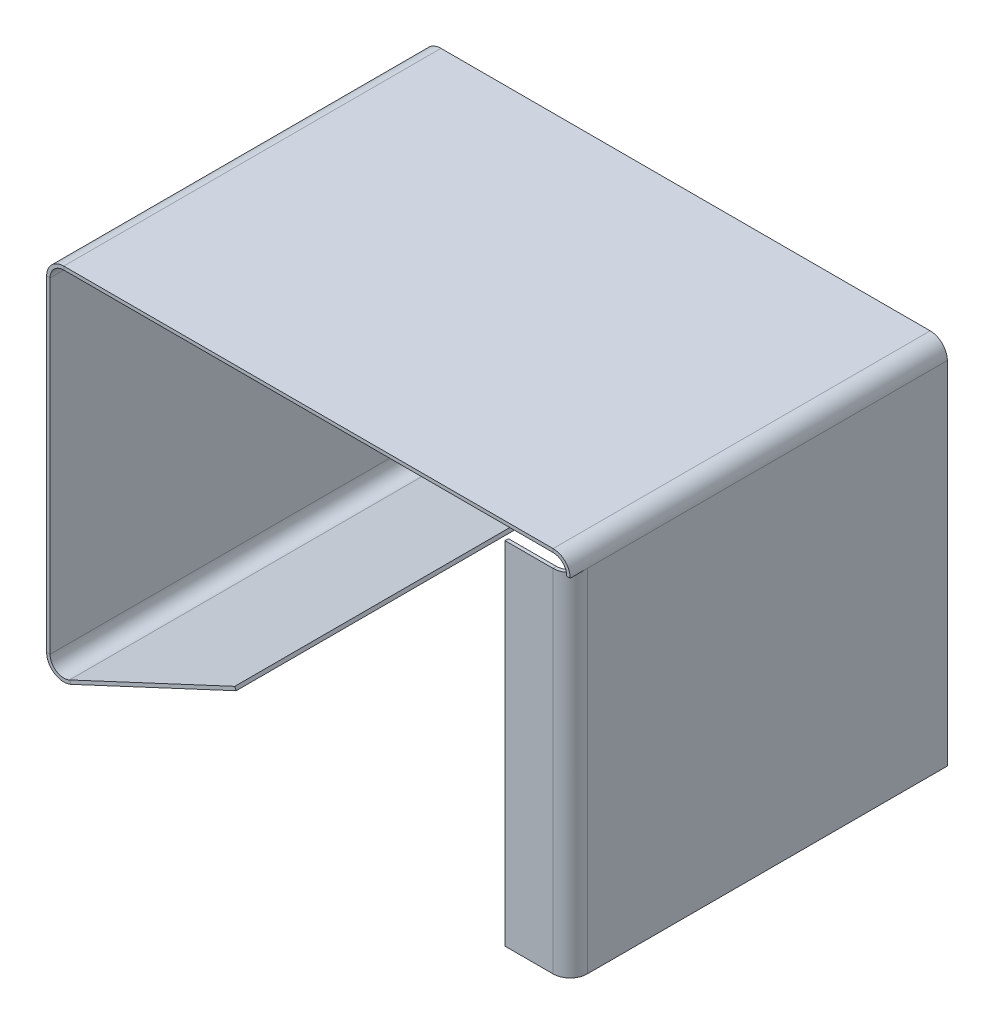
ISO-10303-21;
HEADER;
FILE_DESCRIPTION(('STEP AP214'),'2;1');
FILE_NAME('part.step','',(''),(''),'','','');
FILE_SCHEMA(('AUTOMOTIVE_DESIGN { 1 0 10303 214 1 1 1 1 }'));
ENDSEC;
DATA;
#1=APPLICATION_CONTEXT('core data for automotive mechanical design processes');
#2=APPLICATION_PROTOCOL_DEFINITION('international standard','automotive_design',2000,#1);
#3=PRODUCT_CONTEXT('',#1,'mechanical');
#4=PRODUCT('Part','Part','',(#3));
#5=PRODUCT_RELATED_PRODUCT_CATEGORY('part','',(#4));
#6=PRODUCT_DEFINITION_FORMATION('','',#4);
#7=PRODUCT_DEFINITION_CONTEXT('part definition',#1,'design');
#8=PRODUCT_DEFINITION('design','',#6,#7);
#9=PRODUCT_DEFINITION_SHAPE('','',#8);
#10=(LENGTH_UNIT() NAMED_UNIT(*) SI_UNIT(.MILLI.,.METRE.));
#11=(NAMED_UNIT(*) PLANE_ANGLE_UNIT() SI_UNIT($,.RADIAN.));
#12=(NAMED_UNIT(*) SI_UNIT($,.STERADIAN.) SOLID_ANGLE_UNIT());
#13=UNCERTAINTY_MEASURE_WITH_UNIT(LENGTH_MEASURE(1.E-05),#10,'distance_accuracy_value','');
#14=(GEOMETRIC_REPRESENTATION_CONTEXT(3) GLOBAL_UNCERTAINTY_ASSIGNED_CONTEXT((#13)) GLOBAL_UNIT_ASSIGNED_CONTEXT((#10,
#11,#12)) REPRESENTATION_CONTEXT('',''));
#15=CARTESIAN_POINT('',(0.,0.,0.));
#16=DIRECTION('',(0.,0.,1.));
#17=DIRECTION('',(1.,0.,0.));
#18=AXIS2_PLACEMENT_3D('',#15,#16,#17);
#19=CARTESIAN_POINT('',(75.3483962800155,49.2186624203822,110.));
#20=DIRECTION('',(0.,-1.,0.));
#21=DIRECTION('',(0.,0.,-1.));
#22=AXIS2_PLACEMENT_3D('',#19,#20,#21);
#23=PLANE('',#22);
#24=DIRECTION('',(0.,0.,-1.));
#25=VECTOR('',#24,1.);
#26=CARTESIAN_POINT('',(75.3483962800155,49.2186624203822,110.));
#27=LINE('',#26,#25);
#28=CARTESIAN_POINT('',(75.3483962800155,49.2186624203822,110.));
#29=VERTEX_POINT('',#28);
#30=CARTESIAN_POINT('',(75.3483962800155,49.2186624203822,108.));
#31=VERTEX_POINT('',#30);
#32=EDGE_CURVE('E390',#29,#31,#27,.T.);
#33=ORIENTED_EDGE('',*,*,#32,.T.);
#34=CARTESIAN_POINT('',(71.3483962800156,49.2186624203822,105.));
#35=DIRECTION('',(0.,1.,0.));
#36=DIRECTION('',(0.,0.,1.));
#37=AXIS2_PLACEMENT_3D('',#34,#35,#36);
#38=CIRCLE('',#37,5.);
#39=CARTESIAN_POINT('',(76.3483962800155,49.2186624203822,105.));
#40=VERTEX_POINT('',#39);
#41=EDGE_CURVE('E13',#31,#40,#38,.T.);
#42=ORIENTED_EDGE('',*,*,#41,.T.);
#43=DIRECTION('',(0.,0.,-1.));
#44=VECTOR('',#43,1.);
#45=CARTESIAN_POINT('',(76.3483962800155,49.2186624203822,110.));
#46=LINE('',#45,#44);
#47=CARTESIAN_POINT('',(76.3483962800155,49.2186624203822,110.));
#48=VERTEX_POINT('',#47);
#49=EDGE_CURVE('E411',#48,#40,#46,.T.);
#50=ORIENTED_EDGE('',*,*,#49,.F.);
#51=DIRECTION('',(-1.,0.,0.));
#52=VECTOR('',#51,1.);
#53=CARTESIAN_POINT('',(76.3483962800155,49.2186624203822,110.));
#54=LINE('',#53,#52);
#55=EDGE_CURVE('E423',#48,#29,#54,.T.);
#56=ORIENTED_EDGE('',*,*,#55,.T.);
#57=EDGE_LOOP('',(#33,#42,#50,#56));
#58=FACE_BOUND('',#57,.T.);
#59=ADVANCED_FACE('F77',(#58),#23,.T.);
#60=CARTESIAN_POINT('',(75.3483962800155,53.2186624203822,110.));
#61=DIRECTION('',(1.,0.,0.));
#62=DIRECTION('',(0.,0.,-1.));
#63=AXIS2_PLACEMENT_3D('',#60,#61,#62);
#64=PLANE('',#63);
#65=DIRECTION('',(0.,1.,0.));
#66=VECTOR('',#65,1.);
#67=CARTESIAN_POINT('',(75.3483962800156,49.2186624203822,105.));
#68=LINE('',#67,#66);
#69=CARTESIAN_POINT('',(75.3483962800156,49.2186624203822,105.));
#70=VERTEX_POINT('',#69);
#71=CARTESIAN_POINT('',(75.3483962800155,-53.2186624203822,105.));
#72=VERTEX_POINT('',#71);
#73=EDGE_CURVE('E276',#70,#72,#68,.F.);
#74=ORIENTED_EDGE('',*,*,#73,.F.);
#75=CARTESIAN_POINT('',(75.3483962800155,49.2186624203822,0.));
#76=VERTEX_POINT('',#75);
#77=EDGE_CURVE('E360',#70,#76,#27,.T.);
#78=ORIENTED_EDGE('',*,*,#77,.T.);
#79=DIRECTION('',(0.,-1.,0.));
#80=VECTOR('',#79,1.);
#81=CARTESIAN_POINT('',(75.3483962800155,53.2186624203822,0.));
#82=LINE('',#81,#80);
#83=CARTESIAN_POINT('',(75.3483962800155,-53.2186624203822,0.));
#84=VERTEX_POINT('',#83);
#85=EDGE_CURVE('E334',#76,#84,#82,.T.);
#86=ORIENTED_EDGE('',*,*,#85,.T.);
#87=DIRECTION('',(0.,0.,-1.));
#88=VECTOR('',#87,1.);
#89=CARTESIAN_POINT('',(75.3483962800155,-53.2186624203822,110.));
#90=LINE('',#89,#88);
#91=EDGE_CURVE('E416',#72,#84,#90,.T.);
#92=ORIENTED_EDGE('',*,*,#91,.F.);
#93=EDGE_LOOP('',(#74,#78,#86,#92));
#94=FACE_BOUND('',#93,.T.);
#95=ADVANCED_FACE('F499',(#94),#64,.F.);
#96=CARTESIAN_POINT('',(76.3483962800155,53.2186624203822,110.));
#97=DIRECTION('',(1.,0.,0.));
#98=DIRECTION('',(0.,0.,-1.));
#99=AXIS2_PLACEMENT_3D('',#96,#97,#98);
#100=PLANE('',#99);
#101=CARTESIAN_POINT('',(76.3483962800155,49.2186624203822,0.));
#102=VERTEX_POINT('',#101);
#103=EDGE_CURVE('E410',#40,#102,#46,.T.);
#104=ORIENTED_EDGE('',*,*,#103,.F.);
#105=DIRECTION('',(0.,1.,0.));
#106=VECTOR('',#105,1.);
#107=CARTESIAN_POINT('',(76.3483962800156,49.2186624203822,105.));
#108=LINE('',#107,#106);
#109=CARTESIAN_POINT('',(76.3483962800155,-53.2186624203822,105.));
#110=VERTEX_POINT('',#109);
#111=EDGE_CURVE('E267',#40,#110,#108,.F.);
#112=ORIENTED_EDGE('',*,*,#111,.T.);
#113=DIRECTION('',(0.,0.,-1.));
#114=VECTOR('',#113,1.);
#115=CARTESIAN_POINT('',(76.3483962800155,-53.2186624203822,110.));
#116=LINE('',#115,#114);
#117=CARTESIAN_POINT('',(76.3483962800155,-53.2186624203822,0.));
#118=VERTEX_POINT('',#117);
#119=EDGE_CURVE('E414',#110,#118,#116,.T.);
#120=ORIENTED_EDGE('',*,*,#119,.T.);
#121=DIRECTION('',(0.,1.,0.));
#122=VECTOR('',#121,1.);
#123=CARTESIAN_POINT('',(76.3483962800155,53.2186624203822,0.));
#124=LINE('',#123,#122);
#125=EDGE_CURVE('E366',#102,#118,#124,.F.);
#126=ORIENTED_EDGE('',*,*,#125,.F.);
#127=EDGE_LOOP('',(#104,#112,#120,#126));
#128=FACE_BOUND('',#127,.T.);
#129=ADVANCED_FACE('F477',(#128),#100,.T.);
#130=CARTESIAN_POINT('',(-76.3483962800155,53.2186624203822,110.));
#131=DIRECTION('',(-1.,0.,0.));
#132=DIRECTION('',(0.,0.,1.));
#133=AXIS2_PLACEMENT_3D('',#130,#131,#132);
#134=PLANE('',#133);
#135=DIRECTION('',(0.,1.,0.));
#136=VECTOR('',#135,1.);
#137=CARTESIAN_POINT('',(-76.3483962800155,53.2186624203822,0.));
#138=LINE('',#137,#136);
#139=CARTESIAN_POINT('',(-76.3483962800155,-45.8365421929497,0.));
#140=VERTEX_POINT('',#139);
#141=CARTESIAN_POINT('',(-76.3483962800156,49.2186624203822,0.));
#142=VERTEX_POINT('',#141);
#143=EDGE_CURVE('E378',#140,#142,#138,.T.);
#144=ORIENTED_EDGE('',*,*,#143,.F.);
#145=DIRECTION('',(0.,0.,-1.));
#146=VECTOR('',#145,1.);
#147=CARTESIAN_POINT('',(-76.3483962800155,-45.8365421929497,0.));
#148=LINE('',#147,#146);
#149=CARTESIAN_POINT('',(-76.3483962800155,-45.8365421929498,110.));
#150=VERTEX_POINT('',#149);
#151=EDGE_CURVE('E314',#140,#150,#148,.F.);
#152=ORIENTED_EDGE('',*,*,#151,.T.);
#153=DIRECTION('',(0.,1.,0.));
#154=VECTOR('',#153,1.);
#155=CARTESIAN_POINT('',(-76.3483962800155,53.2186624203822,110.));
#156=LINE('',#155,#154);
#157=CARTESIAN_POINT('',(-76.3483962800156,49.2186624203822,110.));
#158=VERTEX_POINT('',#157);
#159=EDGE_CURVE('E347',#150,#158,#156,.T.);
#160=ORIENTED_EDGE('',*,*,#159,.T.);
#161=DIRECTION('',(0.,0.,-1.));
#162=VECTOR('',#161,1.);
#163=CARTESIAN_POINT('',(-76.3483962800156,49.2186624203822,110.));
#164=LINE('',#163,#162);
#165=EDGE_CURVE('E401',#158,#142,#164,.T.);
#166=ORIENTED_EDGE('',*,*,#165,.T.);
#167=EDGE_LOOP('',(#144,#152,#160,#166));
#168=FACE_BOUND('',#167,.T.);
#169=ADVANCED_FACE('F577',(#168),#134,.T.);
#170=CARTESIAN_POINT('',(-75.3483962800155,53.2186624203822,110.));
#171=DIRECTION('',(-1.,0.,0.));
#172=DIRECTION('',(0.,0.,1.));
#173=AXIS2_PLACEMENT_3D('',#170,#171,#172);
#174=PLANE('',#173);
#175=DIRECTION('',(0.,0.,-1.));
#176=VECTOR('',#175,1.);
#177=CARTESIAN_POINT('',(-75.3483962800155,-45.8365421929497,0.));
#178=LINE('',#177,#176);
#179=CARTESIAN_POINT('',(-75.3483962800155,-45.8365421929497,0.));
#180=VERTEX_POINT('',#179);
#181=CARTESIAN_POINT('',(-75.3483962800155,-45.8365421929497,110.));
#182=VERTEX_POINT('',#181);
#183=EDGE_CURVE('E327',#180,#182,#178,.F.);
#184=ORIENTED_EDGE('',*,*,#183,.F.);
#185=DIRECTION('',(0.,1.,0.));
#186=VECTOR('',#185,1.);
#187=CARTESIAN_POINT('',(-75.3483962800155,53.2186624203822,0.));
#188=LINE('',#187,#186);
#189=CARTESIAN_POINT('',(-75.3483962800155,49.2186624203822,0.));
#190=VERTEX_POINT('',#189);
#191=EDGE_CURVE('E380',#180,#190,#188,.T.);
#192=ORIENTED_EDGE('',*,*,#191,.T.);
#193=DIRECTION('',(0.,0.,-1.));
#194=VECTOR('',#193,1.);
#195=CARTESIAN_POINT('',(-75.3483962800155,49.2186624203822,110.));
#196=LINE('',#195,#194);
#197=CARTESIAN_POINT('',(-75.3483962800155,49.2186624203822,110.));
#198=VERTEX_POINT('',#197);
#199=EDGE_CURVE('E398',#198,#190,#196,.T.);
#200=ORIENTED_EDGE('',*,*,#199,.F.);
#201=DIRECTION('',(0.,1.,0.));
#202=VECTOR('',#201,1.);
#203=CARTESIAN_POINT('',(-75.3483962800155,53.2186624203822,110.));
#204=LINE('',#203,#202);
#205=EDGE_CURVE('E349',#182,#198,#204,.T.);
#206=ORIENTED_EDGE('',*,*,#205,.F.);
#207=EDGE_LOOP('',(#184,#192,#200,#206));
#208=FACE_BOUND('',#207,.T.);
#209=ADVANCED_FACE('F563',(#208),#174,.F.);
#210=CARTESIAN_POINT('',(71.3483962800155,49.2186624203822,0.));
#211=DIRECTION('',(0.,0.,1.));
#212=DIRECTION('',(1.,0.,0.));
#213=AXIS2_PLACEMENT_3D('',#210,#211,#212);
#214=PLANE('',#213);
#215=DIRECTION('',(-1.,0.,0.));
#216=VECTOR('',#215,1.);
#217=CARTESIAN_POINT('',(-75.3483962800155,-45.8365421929497,0.));
#218=LINE('',#217,#216);
#219=EDGE_CURVE('E321',#180,#140,#218,.T.);
#220=ORIENTED_EDGE('',*,*,#219,.T.);
#221=ORIENTED_EDGE('',*,*,#143,.T.);
#222=DIRECTION('',(1.,0.,0.));
#223=VECTOR('',#222,1.);
#224=CARTESIAN_POINT('',(-76.3483962800156,49.2186624203822,0.));
#225=LINE('',#224,#223);
#226=EDGE_CURVE('E428',#142,#190,#225,.T.);
#227=ORIENTED_EDGE('',*,*,#226,.T.);
#228=ORIENTED_EDGE('',*,*,#191,.F.);
#229=EDGE_LOOP('',(#220,#221,#227,#228));
#230=FACE_BOUND('',#229,.T.);
#231=ADVANCED_FACE('F560',(#230),#214,.F.);
#232=CARTESIAN_POINT('',(-75.3483962800155,49.2186624203822,110.));
#233=DIRECTION('',(0.,0.,1.));
#234=DIRECTION('',(1.,0.,0.));
#235=AXIS2_PLACEMENT_3D('',#232,#233,#234);
#236=PLANE('',#235);
#237=DIRECTION('',(-1.,0.,0.));
#238=VECTOR('',#237,1.);
#239=CARTESIAN_POINT('',(-75.3483962800155,49.2186624203822,110.));
#240=LINE('',#239,#238);
#241=EDGE_CURVE('E81',#198,#158,#240,.T.);
#242=ORIENTED_EDGE('',*,*,#241,.F.);
#243=CARTESIAN_POINT('',(-71.3483962800156,49.2186624203822,110.));
#244=DIRECTION('',(0.,0.,1.));
#245=DIRECTION('',(1.,0.,0.));
#246=AXIS2_PLACEMENT_3D('',#243,#244,#245);
#247=CIRCLE('',#246,4.);
#248=CARTESIAN_POINT('',(-71.3483962800155,53.2186624203822,110.));
#249=VERTEX_POINT('',#248);
#250=EDGE_CURVE('E351',#198,#249,#247,.F.);
#251=ORIENTED_EDGE('',*,*,#250,.T.);
#252=DIRECTION('',(0.,-1.,0.));
#253=VECTOR('',#252,1.);
#254=CARTESIAN_POINT('',(-71.3483962800155,54.2186624203822,110.));
#255=LINE('',#254,#253);
#256=CARTESIAN_POINT('',(-71.3483962800155,54.2186624203822,110.));
#257=VERTEX_POINT('',#256);
#258=EDGE_CURVE('E432',#257,#249,#255,.T.);
#259=ORIENTED_EDGE('',*,*,#258,.F.);
#260=CARTESIAN_POINT('',(-71.3483962800156,49.2186624203822,110.));
#261=DIRECTION('',(0.,0.,1.));
#262=DIRECTION('',(1.,0.,0.));
#263=AXIS2_PLACEMENT_3D('',#260,#261,#262);
#264=CIRCLE('',#263,5.);
#265=EDGE_CURVE('E344',#158,#257,#264,.F.);
#266=ORIENTED_EDGE('',*,*,#265,.F.);
#267=EDGE_LOOP('',(#242,#251,#259,#266));
#268=FACE_BOUND('',#267,.T.);
#269=ADVANCED_FACE('F79',(#268),#236,.T.);
#270=CARTESIAN_POINT('',(-71.3483962800155,54.2186624203822,110.));
#271=DIRECTION('',(0.,0.,1.));
#272=DIRECTION('',(1.,0.,0.));
#273=AXIS2_PLACEMENT_3D('',#270,#271,#272);
#274=PLANE('',#273);
#275=DIRECTION('',(-1.,0.,0.));
#276=VECTOR('',#275,1.);
#277=CARTESIAN_POINT('',(-75.3483962800155,-45.8365421929497,110.));
#278=LINE('',#277,#276);
#279=EDGE_CURVE('E331',#182,#150,#278,.T.);
#280=ORIENTED_EDGE('',*,*,#279,.F.);
#281=ORIENTED_EDGE('',*,*,#205,.T.);
#282=ORIENTED_EDGE('',*,*,#241,.T.);
#283=ORIENTED_EDGE('',*,*,#159,.F.);
#284=EDGE_LOOP('',(#280,#281,#282,#283));
#285=FACE_BOUND('',#284,.T.);
#286=ADVANCED_FACE('F441',(#285),#274,.T.);
#287=CARTESIAN_POINT('',(-71.3483962800155,53.2186624203822,0.));
#288=DIRECTION('',(0.,0.,-1.));
#289=DIRECTION('',(-1.,0.,0.));
#290=AXIS2_PLACEMENT_3D('',#287,#288,#289);
#291=PLANE('',#290);
#292=DIRECTION('',(0.,1.,0.));
#293=VECTOR('',#292,1.);
#294=CARTESIAN_POINT('',(-71.3483962800155,53.2186624203822,0.));
#295=LINE('',#294,#293);
#296=CARTESIAN_POINT('',(-71.3483962800155,53.2186624203822,0.));
#297=VERTEX_POINT('',#296);
#298=CARTESIAN_POINT('',(-71.3483962800155,54.2186624203822,0.));
#299=VERTEX_POINT('',#298);
#300=EDGE_CURVE('E431',#297,#299,#295,.T.);
#301=ORIENTED_EDGE('',*,*,#300,.F.);
#302=CARTESIAN_POINT('',(-71.3483962800156,49.2186624203822,0.));
#303=DIRECTION('',(0.,0.,1.));
#304=DIRECTION('',(1.,0.,0.));
#305=AXIS2_PLACEMENT_3D('',#302,#303,#304);
#306=CIRCLE('',#305,4.);
#307=EDGE_CURVE('E382',#190,#297,#306,.F.);
#308=ORIENTED_EDGE('',*,*,#307,.F.);
#309=ORIENTED_EDGE('',*,*,#226,.F.);
#310=CARTESIAN_POINT('',(-71.3483962800156,49.2186624203822,0.));
#311=DIRECTION('',(0.,0.,1.));
#312=DIRECTION('',(1.,0.,0.));
#313=AXIS2_PLACEMENT_3D('',#310,#311,#312);
#314=CIRCLE('',#313,5.);
#315=EDGE_CURVE('E375',#142,#299,#314,.F.);
#316=ORIENTED_EDGE('',*,*,#315,.T.);
#317=EDGE_LOOP('',(#301,#308,#309,#316));
#318=FACE_BOUND('',#317,.T.);
#319=ADVANCED_FACE('F618',(#318),#291,.T.);
#320=CARTESIAN_POINT('',(-76.3483962800156,49.2186624203822,0.));
#321=DIRECTION('',(0.,0.,-1.));
#322=DIRECTION('',(-1.,0.,0.));
#323=AXIS2_PLACEMENT_3D('',#320,#321,#322);
#324=PLANE('',#323);
#325=DIRECTION('',(1.,0.,0.));
#326=VECTOR('',#325,1.);
#327=CARTESIAN_POINT('',(75.3483962800155,53.2186624203822,0.));
#328=LINE('',#327,#326);
#329=CARTESIAN_POINT('',(71.3483962800155,53.2186624203822,0.));
#330=VERTEX_POINT('',#329);
#331=EDGE_CURVE('E385',#297,#330,#328,.T.);
#332=ORIENTED_EDGE('',*,*,#331,.F.);
#333=ORIENTED_EDGE('',*,*,#300,.T.);
#334=DIRECTION('',(1.,0.,0.));
#335=VECTOR('',#334,1.);
#336=CARTESIAN_POINT('',(75.3483962800155,54.2186624203822,0.));
#337=LINE('',#336,#335);
#338=CARTESIAN_POINT('',(71.3483962800155,54.2186624203822,0.));
#339=VERTEX_POINT('',#338);
#340=EDGE_CURVE('E372',#299,#339,#337,.T.);
#341=ORIENTED_EDGE('',*,*,#340,.T.);
#342=DIRECTION('',(0.,-1.,0.));
#343=VECTOR('',#342,1.);
#344=CARTESIAN_POINT('',(71.3483962800155,54.2186624203822,0.));
#345=LINE('',#344,#343);
#346=EDGE_CURVE('E418',#339,#330,#345,.T.);
#347=ORIENTED_EDGE('',*,*,#346,.T.);
#348=EDGE_LOOP('',(#332,#333,#341,#347));
#349=FACE_BOUND('',#348,.T.);
#350=ADVANCED_FACE('F624',(#349),#324,.T.);
#351=CARTESIAN_POINT('',(71.3483962800155,53.2186624203822,110.));
#352=DIRECTION('',(0.,0.,1.));
#353=DIRECTION('',(1.,0.,0.));
#354=AXIS2_PLACEMENT_3D('',#351,#352,#353);
#355=PLANE('',#354);
#356=DIRECTION('',(0.,1.,0.));
#357=VECTOR('',#356,1.);
#358=CARTESIAN_POINT('',(71.3483962800155,53.2186624203822,110.));
#359=LINE('',#358,#357);
#360=CARTESIAN_POINT('',(71.3483962800155,53.2186624203822,110.));
#361=VERTEX_POINT('',#360);
#362=CARTESIAN_POINT('',(71.3483962800155,54.2186624203822,110.));
#363=VERTEX_POINT('',#362);
#364=EDGE_CURVE('E426',#361,#363,#359,.T.);
#365=ORIENTED_EDGE('',*,*,#364,.F.);
#366=CARTESIAN_POINT('',(71.3483962800155,49.2186624203822,110.));
#367=DIRECTION('',(0.,0.,1.));
#368=DIRECTION('',(1.,0.,0.));
#369=AXIS2_PLACEMENT_3D('',#366,#367,#368);
#370=CIRCLE('',#369,4.);
#371=EDGE_CURVE('E357',#361,#29,#370,.F.);
#372=ORIENTED_EDGE('',*,*,#371,.T.);
#373=ORIENTED_EDGE('',*,*,#55,.F.);
#374=CARTESIAN_POINT('',(71.3483962800155,49.2186624203822,110.));
#375=DIRECTION('',(0.,0.,1.));
#376=DIRECTION('',(1.,0.,0.));
#377=AXIS2_PLACEMENT_3D('',#374,#375,#376);
#378=CIRCLE('',#377,5.);
#379=EDGE_CURVE('E337',#363,#48,#378,.F.);
#380=ORIENTED_EDGE('',*,*,#379,.F.);
#381=EDGE_LOOP('',(#365,#372,#373,#380));
#382=FACE_BOUND('',#381,.T.);
#383=ADVANCED_FACE('F467',(#382),#355,.T.);
#384=CARTESIAN_POINT('',(76.3483962800155,49.2186624203822,110.));
#385=DIRECTION('',(0.,0.,1.));
#386=DIRECTION('',(1.,0.,0.));
#387=AXIS2_PLACEMENT_3D('',#384,#385,#386);
#388=PLANE('',#387);
#389=DIRECTION('',(1.,0.,0.));
#390=VECTOR('',#389,1.);
#391=CARTESIAN_POINT('',(75.3483962800155,53.2186624203822,110.));
#392=LINE('',#391,#390);
#393=EDGE_CURVE('E354',#249,#361,#392,.T.);
#394=ORIENTED_EDGE('',*,*,#393,.T.);
#395=ORIENTED_EDGE('',*,*,#364,.T.);
#396=DIRECTION('',(1.,0.,0.));
#397=VECTOR('',#396,1.);
#398=CARTESIAN_POINT('',(75.3483962800155,54.2186624203822,110.));
#399=LINE('',#398,#397);
#400=EDGE_CURVE('E340',#257,#363,#399,.T.);
#401=ORIENTED_EDGE('',*,*,#400,.F.);
#402=ORIENTED_EDGE('',*,*,#258,.T.);
#403=EDGE_LOOP('',(#394,#395,#401,#402));
#404=FACE_BOUND('',#403,.T.);
#405=ADVANCED_FACE('F457',(#404),#388,.T.);
#406=CARTESIAN_POINT('',(75.3483962800155,49.2186624203822,0.));
#407=DIRECTION('',(0.,0.,-1.));
#408=DIRECTION('',(-1.,0.,0.));
#409=AXIS2_PLACEMENT_3D('',#406,#407,#408);
#410=PLANE('',#409);
#411=DIRECTION('',(1.,0.,0.));
#412=VECTOR('',#411,1.);
#413=CARTESIAN_POINT('',(75.3483962800155,49.2186624203822,0.));
#414=LINE('',#413,#412);
#415=EDGE_CURVE('E420',#76,#102,#414,.T.);
#416=ORIENTED_EDGE('',*,*,#415,.F.);
#417=CARTESIAN_POINT('',(71.3483962800155,49.2186624203822,0.));
#418=DIRECTION('',(0.,0.,1.));
#419=DIRECTION('',(1.,0.,0.));
#420=AXIS2_PLACEMENT_3D('',#417,#418,#419);
#421=CIRCLE('',#420,4.);
#422=EDGE_CURVE('E341',#330,#76,#421,.F.);
#423=ORIENTED_EDGE('',*,*,#422,.F.);
#424=ORIENTED_EDGE('',*,*,#346,.F.);
#425=CARTESIAN_POINT('',(71.3483962800155,49.2186624203822,0.));
#426=DIRECTION('',(0.,0.,1.));
#427=DIRECTION('',(1.,0.,0.));
#428=AXIS2_PLACEMENT_3D('',#425,#426,#427);
#429=CIRCLE('',#428,5.);
#430=EDGE_CURVE('E369',#339,#102,#429,.F.);
#431=ORIENTED_EDGE('',*,*,#430,.T.);
#432=EDGE_LOOP('',(#416,#423,#424,#431));
#433=FACE_BOUND('',#432,.T.);
#434=ADVANCED_FACE('F503',(#433),#410,.T.);
#435=CARTESIAN_POINT('',(71.3483962800155,54.2186624203822,0.));
#436=DIRECTION('',(0.,0.,-1.));
#437=DIRECTION('',(-1.,0.,0.));
#438=AXIS2_PLACEMENT_3D('',#435,#436,#437);
#439=PLANE('',#438);
#440=ORIENTED_EDGE('',*,*,#85,.F.);
#441=ORIENTED_EDGE('',*,*,#415,.T.);
#442=ORIENTED_EDGE('',*,*,#125,.T.);
#443=DIRECTION('',(-1.,0.,0.));
#444=VECTOR('',#443,1.);
#445=CARTESIAN_POINT('',(76.3483962800155,-53.2186624203822,0.));
#446=LINE('',#445,#444);
#447=EDGE_CURVE('E363',#118,#84,#446,.T.);
#448=ORIENTED_EDGE('',*,*,#447,.T.);
#449=EDGE_LOOP('',(#440,#441,#442,#448));
#450=FACE_BOUND('',#449,.T.);
#451=ADVANCED_FACE('F506',(#450),#439,.T.);
#452=CARTESIAN_POINT('',(76.3483962800155,-53.2186624203822,110.));
#453=DIRECTION('',(0.,-1.,0.));
#454=DIRECTION('',(0.,0.,-1.));
#455=AXIS2_PLACEMENT_3D('',#452,#453,#454);
#456=PLANE('',#455);
#457=DIRECTION('',(1.,0.,0.));
#458=VECTOR('',#457,1.);
#459=CARTESIAN_POINT('',(75.3483962800156,-53.2186624203822,105.));
#460=LINE('',#459,#458);
#461=EDGE_CURVE('E102',#72,#110,#460,.T.);
#462=ORIENTED_EDGE('',*,*,#461,.F.);
#463=ORIENTED_EDGE('',*,*,#91,.T.);
#464=ORIENTED_EDGE('',*,*,#447,.F.);
#465=ORIENTED_EDGE('',*,*,#119,.F.);
#466=EDGE_LOOP('',(#462,#463,#464,#465));
#467=FACE_BOUND('',#466,.T.);
#468=ADVANCED_FACE('F480',(#467),#456,.T.);
#469=CARTESIAN_POINT('',(71.3483962800155,49.2186624203822,110.));
#470=DIRECTION('',(0.,0.,-1.));
#471=DIRECTION('',(-1.,0.,0.));
#472=AXIS2_PLACEMENT_3D('',#469,#470,#471);
#473=CYLINDRICAL_SURFACE('',#472,5.);
#474=ORIENTED_EDGE('',*,*,#430,.F.);
#475=DIRECTION('',(0.,0.,-1.));
#476=VECTOR('',#475,1.);
#477=CARTESIAN_POINT('',(71.3483962800155,54.2186624203822,110.));
#478=LINE('',#477,#476);
#479=EDGE_CURVE('E407',#363,#339,#478,.T.);
#480=ORIENTED_EDGE('',*,*,#479,.F.);
#481=ORIENTED_EDGE('',*,*,#379,.T.);
#482=ORIENTED_EDGE('',*,*,#49,.T.);
#483=ORIENTED_EDGE('',*,*,#103,.T.);
#484=EDGE_LOOP('',(#474,#480,#481,#482,#483));
#485=FACE_BOUND('',#484,.T.);
#486=ADVANCED_FACE('F465',(#485),#473,.T.);
#487=CARTESIAN_POINT('',(75.3483962800155,54.2186624203822,110.));
#488=DIRECTION('',(0.,1.,0.));
#489=DIRECTION('',(0.,0.,1.));
#490=AXIS2_PLACEMENT_3D('',#487,#488,#489);
#491=PLANE('',#490);
#492=ORIENTED_EDGE('',*,*,#340,.F.);
#493=DIRECTION('',(0.,0.,-1.));
#494=VECTOR('',#493,1.);
#495=CARTESIAN_POINT('',(-71.3483962800155,54.2186624203822,110.));
#496=LINE('',#495,#494);
#497=EDGE_CURVE('E404',#257,#299,#496,.T.);
#498=ORIENTED_EDGE('',*,*,#497,.F.);
#499=ORIENTED_EDGE('',*,*,#400,.T.);
#500=ORIENTED_EDGE('',*,*,#479,.T.);
#501=EDGE_LOOP('',(#492,#498,#499,#500));
#502=FACE_BOUND('',#501,.T.);
#503=ADVANCED_FACE('F456',(#502),#491,.T.);
#504=CARTESIAN_POINT('',(-71.3483962800156,49.2186624203822,110.));
#505=DIRECTION('',(0.,0.,-1.));
#506=DIRECTION('',(-1.,0.,0.));
#507=AXIS2_PLACEMENT_3D('',#504,#505,#506);
#508=CYLINDRICAL_SURFACE('',#507,5.);
#509=ORIENTED_EDGE('',*,*,#315,.F.);
#510=ORIENTED_EDGE('',*,*,#165,.F.);
#511=ORIENTED_EDGE('',*,*,#265,.T.);
#512=ORIENTED_EDGE('',*,*,#497,.T.);
#513=EDGE_LOOP('',(#509,#510,#511,#512));
#514=FACE_BOUND('',#513,.T.);
#515=ADVANCED_FACE('F448',(#514),#508,.T.);
#516=CARTESIAN_POINT('',(-71.3483962800156,49.2186624203822,110.));
#517=DIRECTION('',(0.,0.,-1.));
#518=DIRECTION('',(-1.,0.,0.));
#519=AXIS2_PLACEMENT_3D('',#516,#517,#518);
#520=CYLINDRICAL_SURFACE('',#519,4.);
#521=ORIENTED_EDGE('',*,*,#307,.T.);
#522=DIRECTION('',(0.,0.,-1.));
#523=VECTOR('',#522,1.);
#524=CARTESIAN_POINT('',(-71.3483962800155,53.2186624203822,110.));
#525=LINE('',#524,#523);
#526=EDGE_CURVE('E395',#249,#297,#525,.T.);
#527=ORIENTED_EDGE('',*,*,#526,.F.);
#528=ORIENTED_EDGE('',*,*,#250,.F.);
#529=ORIENTED_EDGE('',*,*,#199,.T.);
#530=EDGE_LOOP('',(#521,#527,#528,#529));
#531=FACE_BOUND('',#530,.T.);
#532=ADVANCED_FACE('F570',(#531),#520,.F.);
#533=CARTESIAN_POINT('',(75.3483962800155,53.2186624203822,110.));
#534=DIRECTION('',(0.,1.,0.));
#535=DIRECTION('',(0.,0.,1.));
#536=AXIS2_PLACEMENT_3D('',#533,#534,#535);
#537=PLANE('',#536);
#538=ORIENTED_EDGE('',*,*,#331,.T.);
#539=DIRECTION('',(0.,0.,-1.));
#540=VECTOR('',#539,1.);
#541=CARTESIAN_POINT('',(71.3483962800155,53.2186624203822,110.));
#542=LINE('',#541,#540);
#543=EDGE_CURVE('E392',#361,#330,#542,.T.);
#544=ORIENTED_EDGE('',*,*,#543,.F.);
#545=ORIENTED_EDGE('',*,*,#393,.F.);
#546=ORIENTED_EDGE('',*,*,#526,.T.);
#547=EDGE_LOOP('',(#538,#544,#545,#546));
#548=FACE_BOUND('',#547,.T.);
#549=ADVANCED_FACE('F567',(#548),#537,.F.);
#550=CARTESIAN_POINT('',(71.3483962800155,49.2186624203822,110.));
#551=DIRECTION('',(0.,0.,-1.));
#552=DIRECTION('',(-1.,0.,0.));
#553=AXIS2_PLACEMENT_3D('',#550,#551,#552);
#554=CYLINDRICAL_SURFACE('',#553,4.);
#555=ORIENTED_EDGE('',*,*,#422,.T.);
#556=ORIENTED_EDGE('',*,*,#77,.F.);
#557=EDGE_CURVE('E94',#31,#70,#27,.T.);
#558=ORIENTED_EDGE('',*,*,#557,.F.);
#559=ORIENTED_EDGE('',*,*,#32,.F.);
#560=ORIENTED_EDGE('',*,*,#371,.F.);
#561=ORIENTED_EDGE('',*,*,#543,.T.);
#562=EDGE_LOOP('',(#555,#556,#558,#559,#560,#561));
#563=FACE_BOUND('',#562,.T.);
#564=ADVANCED_FACE('F505',(#563),#554,.F.);
#565=CARTESIAN_POINT('',(-71.3483962800155,-45.8365421929497,110.));
#566=DIRECTION('',(0.,0.,1.));
#567=DIRECTION('',(1.,0.,0.));
#568=AXIS2_PLACEMENT_3D('',#565,#566,#567);
#569=PLANE('',#568);
#570=DIRECTION('',(-0.422618261740697,0.906307787036651,0.));
#571=VECTOR('',#570,1.);
#572=CARTESIAN_POINT('',(-69.2353049713121,-50.368081128133,110.));
#573=LINE('',#572,#571);
#574=CARTESIAN_POINT('',(-69.6579232330528,-49.4617733410963,110.));
#575=VERTEX_POINT('',#574);
#576=CARTESIAN_POINT('',(-69.2353049713121,-50.368081128133,110.));
#577=VERTEX_POINT('',#576);
#578=EDGE_CURVE('E283',#575,#577,#573,.F.);
#579=ORIENTED_EDGE('',*,*,#578,.F.);
#580=CARTESIAN_POINT('',(-71.3483962800155,-45.8365421929497,110.));
#581=DIRECTION('',(0.,0.,-1.));
#582=DIRECTION('',(-1.,0.,0.));
#583=AXIS2_PLACEMENT_3D('',#580,#581,#582);
#584=CIRCLE('',#583,4.);
#585=EDGE_CURVE('E324',#182,#575,#584,.F.);
#586=ORIENTED_EDGE('',*,*,#585,.F.);
#587=ORIENTED_EDGE('',*,*,#279,.T.);
#588=CARTESIAN_POINT('',(-71.3483962800155,-45.8365421929497,110.));
#589=DIRECTION('',(0.,0.,-1.));
#590=DIRECTION('',(-1.,0.,0.));
#591=AXIS2_PLACEMENT_3D('',#588,#589,#590);
#592=CIRCLE('',#591,5.);
#593=EDGE_CURVE('E317',#150,#577,#592,.F.);
#594=ORIENTED_EDGE('',*,*,#593,.T.);
#595=EDGE_LOOP('',(#579,#586,#587,#594));
#596=FACE_BOUND('',#595,.T.);
#597=ADVANCED_FACE('F553',(#596),#569,.T.);
#598=CARTESIAN_POINT('',(-71.3483962800155,-45.8365421929497,0.));
#599=DIRECTION('',(0.,0.,1.));
#600=DIRECTION('',(1.,0.,0.));
#601=AXIS2_PLACEMENT_3D('',#598,#599,#600);
#602=PLANE('',#601);
#603=CARTESIAN_POINT('',(-71.3483962800155,-45.8365421929497,0.));
#604=DIRECTION('',(0.,0.,-1.));
#605=DIRECTION('',(-1.,0.,0.));
#606=AXIS2_PLACEMENT_3D('',#603,#604,#605);
#607=CIRCLE('',#606,4.);
#608=CARTESIAN_POINT('',(-69.6579232330528,-49.4617733410963,0.));
#609=VERTEX_POINT('',#608);
#610=EDGE_CURVE('E287',#609,#180,#607,.T.);
#611=ORIENTED_EDGE('',*,*,#610,.F.);
#612=DIRECTION('',(-0.422618261740697,0.906307787036651,0.));
#613=VECTOR('',#612,1.);
#614=CARTESIAN_POINT('',(-69.6579232330528,-49.4617733410963,0.));
#615=LINE('',#614,#613);
#616=CARTESIAN_POINT('',(-69.2353049713121,-50.368081128133,0.));
#617=VERTEX_POINT('',#616);
#618=EDGE_CURVE('E307',#609,#617,#615,.F.);
#619=ORIENTED_EDGE('',*,*,#618,.T.);
#620=CARTESIAN_POINT('',(-71.3483962800155,-45.8365421929497,0.));
#621=DIRECTION('',(0.,0.,-1.));
#622=DIRECTION('',(-1.,0.,0.));
#623=AXIS2_PLACEMENT_3D('',#620,#621,#622);
#624=CIRCLE('',#623,5.);
#625=EDGE_CURVE('E318',#617,#140,#624,.T.);
#626=ORIENTED_EDGE('',*,*,#625,.T.);
#627=ORIENTED_EDGE('',*,*,#219,.F.);
#628=EDGE_LOOP('',(#611,#619,#626,#627));
#629=FACE_BOUND('',#628,.T.);
#630=ADVANCED_FACE('F548',(#629),#602,.F.);
#631=CARTESIAN_POINT('',(-71.3483962800155,-45.8365421929497,0.));
#632=DIRECTION('',(0.,0.,-1.));
#633=DIRECTION('',(0.422618261740697,-0.906307787036651,0.));
#634=AXIS2_PLACEMENT_3D('',#631,#632,#633);
#635=CYLINDRICAL_SURFACE('',#634,5.);
#636=ORIENTED_EDGE('',*,*,#151,.F.);
#637=ORIENTED_EDGE('',*,*,#625,.F.);
#638=DIRECTION('',(0.,0.,-1.));
#639=VECTOR('',#638,1.);
#640=CARTESIAN_POINT('',(-69.2353049713121,-50.368081128133,110.));
#641=LINE('',#640,#639);
#642=EDGE_CURVE('E305',#617,#577,#641,.F.);
#643=ORIENTED_EDGE('',*,*,#642,.T.);
#644=ORIENTED_EDGE('',*,*,#593,.F.);
#645=EDGE_LOOP('',(#636,#637,#643,#644));
#646=FACE_BOUND('',#645,.T.);
#647=ADVANCED_FACE('F545',(#646),#635,.T.);
#648=CARTESIAN_POINT('',(-71.3483962800155,-45.8365421929497,0.));
#649=DIRECTION('',(0.,0.,-1.));
#650=DIRECTION('',(0.422618261740697,-0.906307787036651,0.));
#651=AXIS2_PLACEMENT_3D('',#648,#649,#650);
#652=CYLINDRICAL_SURFACE('',#651,4.);
#653=ORIENTED_EDGE('',*,*,#183,.T.);
#654=ORIENTED_EDGE('',*,*,#585,.T.);
#655=DIRECTION('',(0.,0.,-1.));
#656=VECTOR('',#655,1.);
#657=CARTESIAN_POINT('',(-69.6579232330528,-49.4617733410963,110.));
#658=LINE('',#657,#656);
#659=EDGE_CURVE('E310',#575,#609,#658,.T.);
#660=ORIENTED_EDGE('',*,*,#659,.T.);
#661=ORIENTED_EDGE('',*,*,#610,.T.);
#662=EDGE_LOOP('',(#653,#654,#660,#661));
#663=FACE_BOUND('',#662,.T.);
#664=ADVANCED_FACE('F543',(#663),#652,.F.);
#665=CARTESIAN_POINT('',(-74.9257780182749,-53.0215922884563,110.));
#666=DIRECTION('',(0.,0.,-1.));
#667=DIRECTION('',(-1.,0.,0.));
#668=AXIS2_PLACEMENT_3D('',#665,#666,#667);
#669=PLANE('',#668);
#670=ORIENTED_EDGE('',*,*,#578,.T.);
#671=DIRECTION('',(-0.906307787036651,-0.422618261740697,0.));
#672=VECTOR('',#671,1.);
#673=CARTESIAN_POINT('',(7.34885819968493,-14.6562993481054,110.));
#674=LINE('',#673,#672);
#675=CARTESIAN_POINT('',(-21.0636212707798,-27.9052561123547,110.));
#676=VERTEX_POINT('',#675);
#677=EDGE_CURVE('E295',#676,#577,#674,.T.);
#678=ORIENTED_EDGE('',*,*,#677,.F.);
#679=DIRECTION('',(-0.422618261740697,0.906307787036651,0.));
#680=VECTOR('',#679,1.);
#681=CARTESIAN_POINT('',(-21.0636212707798,-27.9052561123547,110.));
#682=LINE('',#681,#680);
#683=CARTESIAN_POINT('',(-21.4862395325205,-26.998948325318,110.));
#684=VERTEX_POINT('',#683);
#685=EDGE_CURVE('E288',#676,#684,#682,.T.);
#686=ORIENTED_EDGE('',*,*,#685,.T.);
#687=DIRECTION('',(0.906307787036651,0.422618261740697,0.));
#688=VECTOR('',#687,1.);
#689=CARTESIAN_POINT('',(-75.3483962800155,-52.1152845014197,110.));
#690=LINE('',#689,#688);
#691=EDGE_CURVE('E302',#684,#575,#690,.F.);
#692=ORIENTED_EDGE('',*,*,#691,.T.);
#693=EDGE_LOOP('',(#670,#678,#686,#692));
#694=FACE_BOUND('',#693,.T.);
#695=ADVANCED_FACE('F539',(#694),#669,.F.);
#696=CARTESIAN_POINT('',(-21.0636212707798,-27.9052561123547,0.));
#697=DIRECTION('',(0.,0.,1.));
#698=DIRECTION('',(1.,0.,0.));
#699=AXIS2_PLACEMENT_3D('',#696,#697,#698);
#700=PLANE('',#699);
#701=ORIENTED_EDGE('',*,*,#618,.F.);
#702=DIRECTION('',(-0.906307787036651,-0.422618261740697,0.));
#703=VECTOR('',#702,1.);
#704=CARTESIAN_POINT('',(-21.4862395325205,-26.998948325318,0.));
#705=LINE('',#704,#703);
#706=CARTESIAN_POINT('',(-21.4862395325205,-26.998948325318,0.));
#707=VERTEX_POINT('',#706);
#708=EDGE_CURVE('E300',#609,#707,#705,.F.);
#709=ORIENTED_EDGE('',*,*,#708,.T.);
#710=DIRECTION('',(-0.422618261740697,0.906307787036651,0.));
#711=VECTOR('',#710,1.);
#712=CARTESIAN_POINT('',(-21.0636212707798,-27.9052561123547,0.));
#713=LINE('',#712,#711);
#714=CARTESIAN_POINT('',(-21.0636212707798,-27.9052561123547,0.));
#715=VERTEX_POINT('',#714);
#716=EDGE_CURVE('E284',#715,#707,#713,.T.);
#717=ORIENTED_EDGE('',*,*,#716,.F.);
#718=DIRECTION('',(0.906307787036651,0.422618261740697,0.));
#719=VECTOR('',#718,1.);
#720=CARTESIAN_POINT('',(7.34885819968493,-14.6562993481054,0.));
#721=LINE('',#720,#719);
#722=EDGE_CURVE('E293',#617,#715,#721,.T.);
#723=ORIENTED_EDGE('',*,*,#722,.F.);
#724=EDGE_LOOP('',(#701,#709,#717,#723));
#725=FACE_BOUND('',#724,.T.);
#726=ADVANCED_FACE('F528',(#725),#700,.F.);
#727=CARTESIAN_POINT('',(7.34885819968493,-14.6562993481054,0.));
#728=DIRECTION('',(-0.422618261740697,0.906307787036651,0.));
#729=DIRECTION('',(-0.906307787036651,-0.422618261740697,0.));
#730=AXIS2_PLACEMENT_3D('',#727,#728,#729);
#731=PLANE('',#730);
#732=ORIENTED_EDGE('',*,*,#642,.F.);
#733=ORIENTED_EDGE('',*,*,#722,.T.);
#734=DIRECTION('',(0.,0.,1.));
#735=VECTOR('',#734,1.);
#736=CARTESIAN_POINT('',(-21.0636212707798,-27.9052561123547,0.));
#737=LINE('',#736,#735);
#738=EDGE_CURVE('E291',#715,#676,#737,.T.);
#739=ORIENTED_EDGE('',*,*,#738,.T.);
#740=ORIENTED_EDGE('',*,*,#677,.T.);
#741=EDGE_LOOP('',(#732,#733,#739,#740));
#742=FACE_BOUND('',#741,.T.);
#743=ADVANCED_FACE('F524',(#742),#731,.F.);
#744=CARTESIAN_POINT('',(6.92623993794423,-13.7499915610687,0.));
#745=DIRECTION('',(-0.422618261740697,0.906307787036651,0.));
#746=DIRECTION('',(-0.906307787036651,-0.422618261740697,0.));
#747=AXIS2_PLACEMENT_3D('',#744,#745,#746);
#748=PLANE('',#747);
#749=ORIENTED_EDGE('',*,*,#708,.F.);
#750=ORIENTED_EDGE('',*,*,#659,.F.);
#751=ORIENTED_EDGE('',*,*,#691,.F.);
#752=DIRECTION('',(0.,0.,-1.));
#753=VECTOR('',#752,1.);
#754=CARTESIAN_POINT('',(-21.4862395325205,-26.998948325318,110.));
#755=LINE('',#754,#753);
#756=EDGE_CURVE('E298',#707,#684,#755,.F.);
#757=ORIENTED_EDGE('',*,*,#756,.F.);
#758=EDGE_LOOP('',(#749,#750,#751,#757));
#759=FACE_BOUND('',#758,.T.);
#760=ADVANCED_FACE('F527',(#759),#748,.T.);
#761=CARTESIAN_POINT('',(-21.0636212707798,-27.9052561123547,110.));
#762=DIRECTION('',(-0.906307787036651,-0.422618261740697,0.));
#763=DIRECTION('',(0.422618261740697,-0.906307787036651,0.));
#764=AXIS2_PLACEMENT_3D('',#761,#762,#763);
#765=PLANE('',#764);
#766=ORIENTED_EDGE('',*,*,#756,.T.);
#767=ORIENTED_EDGE('',*,*,#685,.F.);
#768=ORIENTED_EDGE('',*,*,#738,.F.);
#769=ORIENTED_EDGE('',*,*,#716,.T.);
#770=EDGE_LOOP('',(#766,#767,#768,#769));
#771=FACE_BOUND('',#770,.T.);
#772=ADVANCED_FACE('F532',(#771),#765,.F.);
#773=CARTESIAN_POINT('',(71.3483962800156,-53.2186624203822,105.));
#774=DIRECTION('',(0.,-1.,0.));
#775=DIRECTION('',(0.,0.,-1.));
#776=AXIS2_PLACEMENT_3D('',#773,#774,#775);
#777=PLANE('',#776);
#778=DIRECTION('',(0.,0.,-1.));
#779=VECTOR('',#778,1.);
#780=CARTESIAN_POINT('',(71.3483962800156,-53.2186624203822,110.));
#781=LINE('',#780,#779);
#782=CARTESIAN_POINT('',(71.3483962800156,-53.2186624203822,109.));
#783=VERTEX_POINT('',#782);
#784=CARTESIAN_POINT('',(71.3483962800156,-53.2186624203822,110.));
#785=VERTEX_POINT('',#784);
#786=EDGE_CURVE('E249',#783,#785,#781,.F.);
#787=ORIENTED_EDGE('',*,*,#786,.F.);
#788=CARTESIAN_POINT('',(71.3483962800156,-53.2186624203822,105.));
#789=DIRECTION('',(0.,1.,0.));
#790=DIRECTION('',(0.,0.,1.));
#791=AXIS2_PLACEMENT_3D('',#788,#789,#790);
#792=CIRCLE('',#791,4.);
#793=EDGE_CURVE('E273',#72,#783,#792,.F.);
#794=ORIENTED_EDGE('',*,*,#793,.F.);
#795=ORIENTED_EDGE('',*,*,#461,.T.);
#796=CARTESIAN_POINT('',(71.3483962800156,-53.2186624203822,105.));
#797=DIRECTION('',(0.,1.,0.));
#798=DIRECTION('',(0.,0.,1.));
#799=AXIS2_PLACEMENT_3D('',#796,#797,#798);
#800=CIRCLE('',#799,5.);
#801=EDGE_CURVE('E269',#110,#785,#800,.F.);
#802=ORIENTED_EDGE('',*,*,#801,.T.);
#803=EDGE_LOOP('',(#787,#794,#795,#802));
#804=FACE_BOUND('',#803,.T.);
#805=ADVANCED_FACE('F483',(#804),#777,.T.);
#806=CARTESIAN_POINT('',(71.3483962800156,49.2186624203822,105.));
#807=DIRECTION('',(0.,-1.,0.));
#808=DIRECTION('',(0.,0.,-1.));
#809=AXIS2_PLACEMENT_3D('',#806,#807,#808);
#810=PLANE('',#809);
#811=CARTESIAN_POINT('',(71.3483962800156,49.2186624203822,110.));
#812=VERTEX_POINT('',#811);
#813=EDGE_CURVE('E87',#812,#31,#38,.T.);
#814=ORIENTED_EDGE('',*,*,#813,.T.);
#815=ORIENTED_EDGE('',*,*,#557,.T.);
#816=CARTESIAN_POINT('',(71.3483962800156,49.2186624203822,105.));
#817=DIRECTION('',(0.,1.,0.));
#818=DIRECTION('',(0.,0.,1.));
#819=AXIS2_PLACEMENT_3D('',#816,#817,#818);
#820=CIRCLE('',#819,4.);
#821=CARTESIAN_POINT('',(71.3483962800156,49.2186624203822,109.));
#822=VERTEX_POINT('',#821);
#823=EDGE_CURVE('E279',#822,#70,#820,.T.);
#824=ORIENTED_EDGE('',*,*,#823,.F.);
#825=DIRECTION('',(0.,0.,-1.));
#826=VECTOR('',#825,1.);
#827=CARTESIAN_POINT('',(71.3483962800156,49.2186624203822,109.));
#828=LINE('',#827,#826);
#829=EDGE_CURVE('E261',#822,#812,#828,.F.);
#830=ORIENTED_EDGE('',*,*,#829,.T.);
#831=EDGE_LOOP('',(#814,#815,#824,#830));
#832=FACE_BOUND('',#831,.T.);
#833=ADVANCED_FACE('F496',(#832),#810,.F.);
#834=CARTESIAN_POINT('',(71.3483962800156,49.2186624203822,105.));
#835=DIRECTION('',(0.,1.,0.));
#836=DIRECTION('',(0.,0.,1.));
#837=AXIS2_PLACEMENT_3D('',#834,#835,#836);
#838=CYLINDRICAL_SURFACE('',#837,5.);
#839=ORIENTED_EDGE('',*,*,#111,.F.);
#840=ORIENTED_EDGE('',*,*,#41,.F.);
#841=ORIENTED_EDGE('',*,*,#813,.F.);
#842=DIRECTION('',(0.,1.,0.));
#843=VECTOR('',#842,1.);
#844=CARTESIAN_POINT('',(71.3483962800156,-53.2186624203822,110.));
#845=LINE('',#844,#843);
#846=EDGE_CURVE('E259',#812,#785,#845,.F.);
#847=ORIENTED_EDGE('',*,*,#846,.T.);
#848=ORIENTED_EDGE('',*,*,#801,.F.);
#849=EDGE_LOOP('',(#839,#840,#841,#847,#848));
#850=FACE_BOUND('',#849,.T.);
#851=ADVANCED_FACE('F475',(#850),#838,.T.);
#852=CARTESIAN_POINT('',(71.3483962800156,49.2186624203822,105.));
#853=DIRECTION('',(0.,1.,0.));
#854=DIRECTION('',(0.,0.,1.));
#855=AXIS2_PLACEMENT_3D('',#852,#853,#854);
#856=CYLINDRICAL_SURFACE('',#855,4.);
#857=ORIENTED_EDGE('',*,*,#73,.T.);
#858=ORIENTED_EDGE('',*,*,#793,.T.);
#859=DIRECTION('',(0.,1.,0.));
#860=VECTOR('',#859,1.);
#861=CARTESIAN_POINT('',(71.3483962800156,-53.2186624203822,109.));
#862=LINE('',#861,#860);
#863=EDGE_CURVE('E264',#783,#822,#862,.T.);
#864=ORIENTED_EDGE('',*,*,#863,.T.);
#865=ORIENTED_EDGE('',*,*,#823,.T.);
#866=EDGE_LOOP('',(#857,#858,#864,#865));
#867=FACE_BOUND('',#866,.T.);
#868=ADVANCED_FACE('F486',(#867),#856,.F.);
#869=CARTESIAN_POINT('',(57.3483962800156,49.2186624203822,110.));
#870=DIRECTION('',(0.,-1.,0.));
#871=DIRECTION('',(0.,0.,-1.));
#872=AXIS2_PLACEMENT_3D('',#869,#870,#871);
#873=PLANE('',#872);
#874=ORIENTED_EDGE('',*,*,#829,.F.);
#875=DIRECTION('',(1.,0.,0.));
#876=VECTOR('',#875,1.);
#877=CARTESIAN_POINT('',(57.3483962800155,49.2186624203822,109.));
#878=LINE('',#877,#876);
#879=CARTESIAN_POINT('',(57.3483962800155,49.2186624203822,109.));
#880=VERTEX_POINT('',#879);
#881=EDGE_CURVE('E257',#822,#880,#878,.F.);
#882=ORIENTED_EDGE('',*,*,#881,.T.);
#883=DIRECTION('',(0.,0.,-1.));
#884=VECTOR('',#883,1.);
#885=CARTESIAN_POINT('',(57.3483962800156,49.2186624203822,110.));
#886=LINE('',#885,#884);
#887=CARTESIAN_POINT('',(57.3483962800156,49.2186624203822,110.));
#888=VERTEX_POINT('',#887);
#889=EDGE_CURVE('E245',#888,#880,#886,.T.);
#890=ORIENTED_EDGE('',*,*,#889,.F.);
#891=DIRECTION('',(-1.,0.,0.));
#892=VECTOR('',#891,1.);
#893=CARTESIAN_POINT('',(4.2753499768873E-13,49.2186624203822,110.));
#894=LINE('',#893,#892);
#895=EDGE_CURVE('E232',#812,#888,#894,.T.);
#896=ORIENTED_EDGE('',*,*,#895,.F.);
#897=EDGE_LOOP('',(#874,#882,#890,#896));
#898=FACE_BOUND('',#897,.T.);
#899=ADVANCED_FACE('F494',(#898),#873,.F.);
#900=CARTESIAN_POINT('',(75.3483962800155,-53.2186624203822,110.));
#901=DIRECTION('',(0.,1.,0.));
#902=DIRECTION('',(0.,0.,1.));
#903=AXIS2_PLACEMENT_3D('',#900,#901,#902);
#904=PLANE('',#903);
#905=ORIENTED_EDGE('',*,*,#786,.T.);
#906=DIRECTION('',(1.,0.,0.));
#907=VECTOR('',#906,1.);
#908=CARTESIAN_POINT('',(4.2753499768873E-13,-53.2186624203822,110.));
#909=LINE('',#908,#907);
#910=CARTESIAN_POINT('',(57.3483962800156,-53.2186624203822,110.));
#911=VERTEX_POINT('',#910);
#912=EDGE_CURVE('E230',#911,#785,#909,.T.);
#913=ORIENTED_EDGE('',*,*,#912,.F.);
#914=DIRECTION('',(0.,0.,-1.));
#915=VECTOR('',#914,1.);
#916=CARTESIAN_POINT('',(57.3483962800156,-53.2186624203822,110.));
#917=LINE('',#916,#915);
#918=CARTESIAN_POINT('',(57.3483962800155,-53.2186624203822,109.));
#919=VERTEX_POINT('',#918);
#920=EDGE_CURVE('E238',#911,#919,#917,.T.);
#921=ORIENTED_EDGE('',*,*,#920,.T.);
#922=DIRECTION('',(-1.,0.,0.));
#923=VECTOR('',#922,1.);
#924=CARTESIAN_POINT('',(75.3483962800155,-53.2186624203822,109.));
#925=LINE('',#924,#923);
#926=EDGE_CURVE('E254',#919,#783,#925,.F.);
#927=ORIENTED_EDGE('',*,*,#926,.T.);
#928=EDGE_LOOP('',(#905,#913,#921,#927));
#929=FACE_BOUND('',#928,.T.);
#930=ADVANCED_FACE('F248',(#929),#904,.F.);
#931=CARTESIAN_POINT('',(4.2753499768873E-13,0.,110.));
#932=DIRECTION('',(0.,0.,-1.));
#933=DIRECTION('',(-1.,0.,0.));
#934=AXIS2_PLACEMENT_3D('',#931,#932,#933);
#935=PLANE('',#934);
#936=ORIENTED_EDGE('',*,*,#846,.F.);
#937=ORIENTED_EDGE('',*,*,#895,.T.);
#938=DIRECTION('',(0.,-1.,0.));
#939=VECTOR('',#938,1.);
#940=CARTESIAN_POINT('',(57.3483962800156,0.,110.));
#941=LINE('',#940,#939);
#942=EDGE_CURVE('E225',#888,#911,#941,.T.);
#943=ORIENTED_EDGE('',*,*,#942,.T.);
#944=ORIENTED_EDGE('',*,*,#912,.T.);
#945=EDGE_LOOP('',(#936,#937,#943,#944));
#946=FACE_BOUND('',#945,.T.);
#947=ADVANCED_FACE('F228',(#946),#935,.F.);
#948=CARTESIAN_POINT('',(4.24043516349887E-13,0.,109.));
#949=DIRECTION('',(0.,0.,-1.));
#950=DIRECTION('',(-1.,0.,0.));
#951=AXIS2_PLACEMENT_3D('',#948,#949,#950);
#952=PLANE('',#951);
#953=ORIENTED_EDGE('',*,*,#881,.F.);
#954=ORIENTED_EDGE('',*,*,#863,.F.);
#955=ORIENTED_EDGE('',*,*,#926,.F.);
#956=DIRECTION('',(0.,1.,0.));
#957=VECTOR('',#956,1.);
#958=CARTESIAN_POINT('',(57.3483962800155,-53.2186624203822,109.));
#959=LINE('',#958,#957);
#960=EDGE_CURVE('E241',#880,#919,#959,.F.);
#961=ORIENTED_EDGE('',*,*,#960,.F.);
#962=EDGE_LOOP('',(#953,#954,#955,#961));
#963=FACE_BOUND('',#962,.T.);
#964=ADVANCED_FACE('F491',(#963),#952,.T.);
#965=CARTESIAN_POINT('',(57.3483962800156,-53.2186624203822,110.));
#966=DIRECTION('',(1.,0.,0.));
#967=DIRECTION('',(0.,0.,-1.));
#968=AXIS2_PLACEMENT_3D('',#965,#966,#967);
#969=PLANE('',#968);
#970=ORIENTED_EDGE('',*,*,#960,.T.);
#971=ORIENTED_EDGE('',*,*,#920,.F.);
#972=ORIENTED_EDGE('',*,*,#942,.F.);
#973=ORIENTED_EDGE('',*,*,#889,.T.);
#974=EDGE_LOOP('',(#970,#971,#972,#973));
#975=FACE_BOUND('',#974,.T.);
#976=ADVANCED_FACE('F239',(#975),#969,.F.);
#977=CLOSED_SHELL('',(#59,#95,#129,#169,#209,#231,#269,#286,#319,#350,#383,#405,#434,#451,#468,
#486,#503,#515,#532,#549,#564,#597,#630,#647,#664,#695,#726,#743,#760,#772,#805,#833,#851,#868,
#899,#930,#947,#964,#976));
#978=MANIFOLD_SOLID_BREP('B2',#977);
#979=ADVANCED_BREP_SHAPE_REPRESENTATION('',(#18,#978),#14);
#980=SHAPE_DEFINITION_REPRESENTATION(#9,#979);
ENDSEC;
END-ISO-10303-21;
